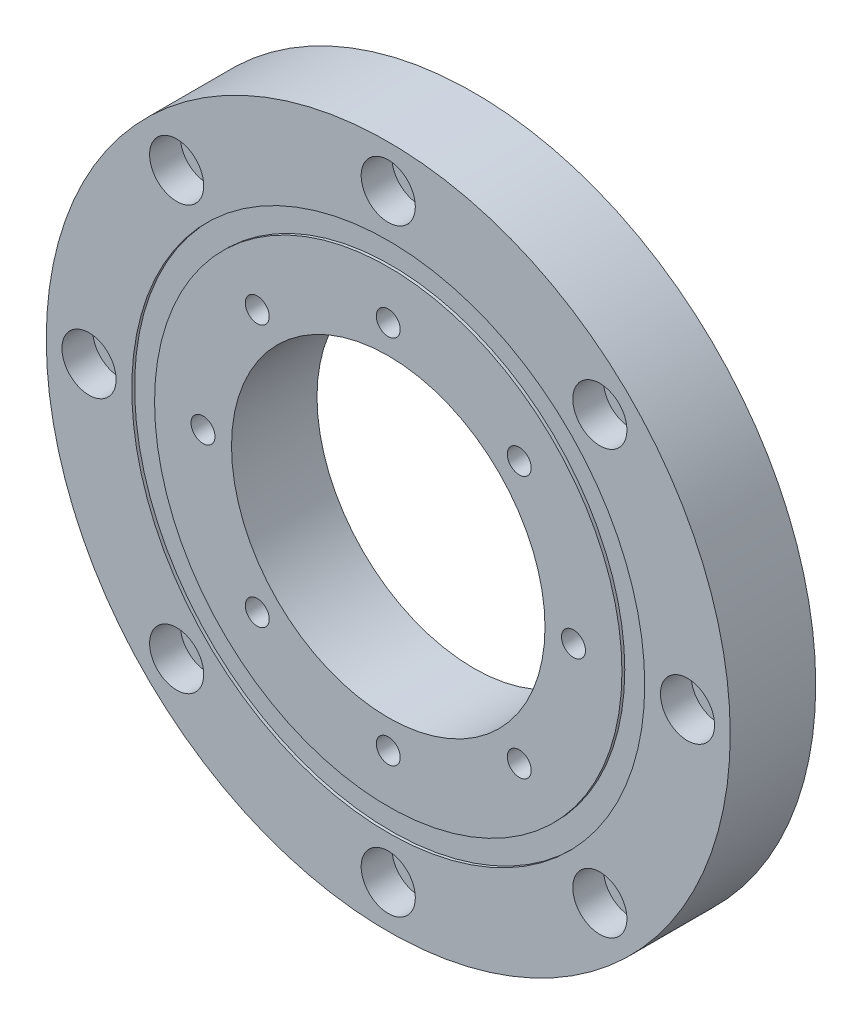
ISO-10303-21;
HEADER;
FILE_DESCRIPTION(('STEP AP214'),'2;1');
FILE_NAME('part.step','',(''),(''),'','','');
FILE_SCHEMA(('AUTOMOTIVE_DESIGN { 1 0 10303 214 1 1 1 1 }'));
ENDSEC;
DATA;
#1=APPLICATION_CONTEXT('core data for automotive mechanical design processes');
#2=APPLICATION_PROTOCOL_DEFINITION('international standard','automotive_design',2000,#1);
#3=PRODUCT_CONTEXT('',#1,'mechanical');
#4=PRODUCT('Part','Part','',(#3));
#5=PRODUCT_RELATED_PRODUCT_CATEGORY('part','',(#4));
#6=PRODUCT_DEFINITION_FORMATION('','',#4);
#7=PRODUCT_DEFINITION_CONTEXT('part definition',#1,'design');
#8=PRODUCT_DEFINITION('design','',#6,#7);
#9=PRODUCT_DEFINITION_SHAPE('','',#8);
#10=(LENGTH_UNIT() NAMED_UNIT(*) SI_UNIT(.MILLI.,.METRE.));
#11=(NAMED_UNIT(*) PLANE_ANGLE_UNIT() SI_UNIT($,.RADIAN.));
#12=(NAMED_UNIT(*) SI_UNIT($,.STERADIAN.) SOLID_ANGLE_UNIT());
#13=UNCERTAINTY_MEASURE_WITH_UNIT(LENGTH_MEASURE(1.E-05),#10,'distance_accuracy_value','');
#14=(GEOMETRIC_REPRESENTATION_CONTEXT(3) GLOBAL_UNCERTAINTY_ASSIGNED_CONTEXT((#13)) GLOBAL_UNIT_ASSIGNED_CONTEXT((#10,
#11,#12)) REPRESENTATION_CONTEXT('',''));
#15=CARTESIAN_POINT('',(0.,0.,0.));
#16=DIRECTION('',(0.,0.,1.));
#17=DIRECTION('',(1.,0.,0.));
#18=AXIS2_PLACEMENT_3D('',#15,#16,#17);
#19=CARTESIAN_POINT('',(0.,0.,-7.5));
#20=DIRECTION('',(0.,0.,1.));
#21=DIRECTION('',(1.,0.,0.));
#22=AXIS2_PLACEMENT_3D('',#19,#20,#21);
#23=PLANE('',#22);
#24=CARTESIAN_POINT('',(22.9809703885625,22.9809703885631,-7.5));
#25=DIRECTION('',(0.,0.,1.));
#26=DIRECTION('',(1.,0.,0.));
#27=AXIS2_PLACEMENT_3D('',#24,#25,#26);
#28=CIRCLE('',#27,2.1);
#29=CARTESIAN_POINT('',(25.0809703885625,22.9809703885631,-7.5));
#30=VERTEX_POINT('',#29);
#31=EDGE_CURVE('E212',#30,#30,#28,.T.);
#32=ORIENTED_EDGE('',*,*,#31,.T.);
#33=EDGE_LOOP('',(#32));
#34=FACE_BOUND('',#33,.T.);
#35=CARTESIAN_POINT('',(32.5,3.40419430537206E-13,-7.5));
#36=DIRECTION('',(0.,0.,1.));
#37=DIRECTION('',(1.,0.,0.));
#38=AXIS2_PLACEMENT_3D('',#35,#36,#37);
#39=CIRCLE('',#38,2.1);
#40=CARTESIAN_POINT('',(34.6,3.40419430537206E-13,-7.5));
#41=VERTEX_POINT('',#40);
#42=EDGE_CURVE('E206',#41,#41,#39,.T.);
#43=ORIENTED_EDGE('',*,*,#42,.T.);
#44=EDGE_LOOP('',(#43));
#45=FACE_BOUND('',#44,.T.);
#46=CARTESIAN_POINT('',(22.980970388563,-22.9809703885626,-7.5));
#47=DIRECTION('',(0.,0.,1.));
#48=DIRECTION('',(1.,0.,0.));
#49=AXIS2_PLACEMENT_3D('',#46,#47,#48);
#50=CIRCLE('',#49,2.1);
#51=CARTESIAN_POINT('',(25.080970388563,-22.9809703885626,-7.5));
#52=VERTEX_POINT('',#51);
#53=EDGE_CURVE('E200',#52,#52,#50,.T.);
#54=ORIENTED_EDGE('',*,*,#53,.T.);
#55=EDGE_LOOP('',(#54));
#56=FACE_BOUND('',#55,.T.);
#57=CARTESIAN_POINT('',(0.,-32.5,-7.5));
#58=DIRECTION('',(0.,0.,1.));
#59=DIRECTION('',(1.,0.,0.));
#60=AXIS2_PLACEMENT_3D('',#57,#58,#59);
#61=CIRCLE('',#60,2.1);
#62=CARTESIAN_POINT('',(2.1,-32.5,-7.5));
#63=VERTEX_POINT('',#62);
#64=EDGE_CURVE('E194',#63,#63,#61,.T.);
#65=ORIENTED_EDGE('',*,*,#64,.T.);
#66=EDGE_LOOP('',(#65));
#67=FACE_BOUND('',#66,.T.);
#68=CARTESIAN_POINT('',(-22.9809703885627,-22.9809703885629,-7.5));
#69=DIRECTION('',(0.,0.,1.));
#70=DIRECTION('',(1.,0.,0.));
#71=AXIS2_PLACEMENT_3D('',#68,#69,#70);
#72=CIRCLE('',#71,2.1);
#73=CARTESIAN_POINT('',(-20.8809703885627,-22.9809703885629,-7.5));
#74=VERTEX_POINT('',#73);
#75=EDGE_CURVE('E188',#74,#74,#72,.T.);
#76=ORIENTED_EDGE('',*,*,#75,.T.);
#77=EDGE_LOOP('',(#76));
#78=FACE_BOUND('',#77,.T.);
#79=CARTESIAN_POINT('',(-32.5,-1.13473143512402E-13,-7.5));
#80=DIRECTION('',(0.,0.,1.));
#81=DIRECTION('',(1.,0.,0.));
#82=AXIS2_PLACEMENT_3D('',#79,#80,#81);
#83=CIRCLE('',#82,2.1);
#84=CARTESIAN_POINT('',(-30.4,-1.13473143512402E-13,-7.5));
#85=VERTEX_POINT('',#84);
#86=EDGE_CURVE('E182',#85,#85,#83,.T.);
#87=ORIENTED_EDGE('',*,*,#86,.T.);
#88=EDGE_LOOP('',(#87));
#89=FACE_BOUND('',#88,.T.);
#90=CARTESIAN_POINT('',(-22.9809703885628,22.9809703885628,-7.5));
#91=DIRECTION('',(0.,0.,1.));
#92=DIRECTION('',(1.,0.,0.));
#93=AXIS2_PLACEMENT_3D('',#90,#91,#92);
#94=CIRCLE('',#93,2.1);
#95=CARTESIAN_POINT('',(-20.8809703885628,22.9809703885628,-7.5));
#96=VERTEX_POINT('',#95);
#97=EDGE_CURVE('E176',#96,#96,#94,.T.);
#98=ORIENTED_EDGE('',*,*,#97,.T.);
#99=EDGE_LOOP('',(#98));
#100=FACE_BOUND('',#99,.T.);
#101=CARTESIAN_POINT('',(0.,32.5,-7.5));
#102=DIRECTION('',(0.,0.,1.));
#103=DIRECTION('',(1.,0.,0.));
#104=AXIS2_PLACEMENT_3D('',#101,#102,#103);
#105=CIRCLE('',#104,2.1);
#106=CARTESIAN_POINT('',(2.1,32.5,-7.5));
#107=VERTEX_POINT('',#106);
#108=EDGE_CURVE('E86',#107,#107,#105,.T.);
#109=ORIENTED_EDGE('',*,*,#108,.T.);
#110=EDGE_LOOP('',(#109));
#111=FACE_BOUND('',#110,.T.);
#112=CARTESIAN_POINT('',(0.,0.,-7.5));
#113=DIRECTION('',(0.,0.,1.));
#114=DIRECTION('',(1.,0.,0.));
#115=AXIS2_PLACEMENT_3D('',#112,#113,#114);
#116=CIRCLE('',#115,27.5);
#117=CARTESIAN_POINT('',(27.5,0.,-7.5));
#118=VERTEX_POINT('',#117);
#119=EDGE_CURVE('E43',#118,#118,#116,.T.);
#120=ORIENTED_EDGE('',*,*,#119,.T.);
#121=EDGE_LOOP('',(#120));
#122=FACE_BOUND('',#121,.T.);
#123=CARTESIAN_POINT('',(0.,0.,-7.5));
#124=DIRECTION('',(0.,0.,1.));
#125=DIRECTION('',(1.,0.,0.));
#126=AXIS2_PLACEMENT_3D('',#123,#124,#125);
#127=CIRCLE('',#126,41.);
#128=CARTESIAN_POINT('',(41.,0.,-7.5));
#129=VERTEX_POINT('',#128);
#130=EDGE_CURVE('E69',#129,#129,#127,.T.);
#131=ORIENTED_EDGE('',*,*,#130,.F.);
#132=EDGE_LOOP('',(#131));
#133=FACE_BOUND('',#132,.T.);
#134=ADVANCED_FACE('F32',(#34,#45,#56,#67,#78,#89,#100,#111,#122,#133),#23,.F.);
#135=CARTESIAN_POINT('',(0.,0.,7.5));
#136=DIRECTION('',(0.,0.,1.));
#137=DIRECTION('',(1.,0.,0.));
#138=AXIS2_PLACEMENT_3D('',#135,#136,#137);
#139=PLANE('',#138);
#140=CARTESIAN_POINT('',(22.9809703885625,22.9809703885631,7.5));
#141=DIRECTION('',(0.,0.,1.));
#142=DIRECTION('',(1.,0.,0.));
#143=AXIS2_PLACEMENT_3D('',#140,#141,#142);
#144=CIRCLE('',#143,2.09999999999999);
#145=CARTESIAN_POINT('',(25.0809703885625,22.9809703885631,7.5));
#146=VERTEX_POINT('',#145);
#147=EDGE_CURVE('E215',#146,#146,#144,.T.);
#148=ORIENTED_EDGE('',*,*,#147,.F.);
#149=EDGE_LOOP('',(#148));
#150=FACE_BOUND('',#149,.T.);
#151=CARTESIAN_POINT('',(32.5,3.40419430537206E-13,7.5));
#152=DIRECTION('',(0.,0.,1.));
#153=DIRECTION('',(1.,0.,0.));
#154=AXIS2_PLACEMENT_3D('',#151,#152,#153);
#155=CIRCLE('',#154,2.09999999999999);
#156=CARTESIAN_POINT('',(34.6,3.40419430537206E-13,7.5));
#157=VERTEX_POINT('',#156);
#158=EDGE_CURVE('E209',#157,#157,#155,.T.);
#159=ORIENTED_EDGE('',*,*,#158,.F.);
#160=EDGE_LOOP('',(#159));
#161=FACE_BOUND('',#160,.T.);
#162=CARTESIAN_POINT('',(22.980970388563,-22.9809703885626,7.5));
#163=DIRECTION('',(0.,0.,1.));
#164=DIRECTION('',(1.,0.,0.));
#165=AXIS2_PLACEMENT_3D('',#162,#163,#164);
#166=CIRCLE('',#165,2.09999999999999);
#167=CARTESIAN_POINT('',(25.080970388563,-22.9809703885626,7.5));
#168=VERTEX_POINT('',#167);
#169=EDGE_CURVE('E203',#168,#168,#166,.T.);
#170=ORIENTED_EDGE('',*,*,#169,.F.);
#171=EDGE_LOOP('',(#170));
#172=FACE_BOUND('',#171,.T.);
#173=CARTESIAN_POINT('',(0.,-32.5,7.5));
#174=DIRECTION('',(0.,0.,1.));
#175=DIRECTION('',(1.,0.,0.));
#176=AXIS2_PLACEMENT_3D('',#173,#174,#175);
#177=CIRCLE('',#176,2.09999999999999);
#178=CARTESIAN_POINT('',(2.09999999999999,-32.5,7.5));
#179=VERTEX_POINT('',#178);
#180=EDGE_CURVE('E197',#179,#179,#177,.T.);
#181=ORIENTED_EDGE('',*,*,#180,.F.);
#182=EDGE_LOOP('',(#181));
#183=FACE_BOUND('',#182,.T.);
#184=CARTESIAN_POINT('',(-22.9809703885627,-22.9809703885629,7.5));
#185=DIRECTION('',(0.,0.,1.));
#186=DIRECTION('',(1.,0.,0.));
#187=AXIS2_PLACEMENT_3D('',#184,#185,#186);
#188=CIRCLE('',#187,2.09999999999999);
#189=CARTESIAN_POINT('',(-20.8809703885627,-22.9809703885629,7.5));
#190=VERTEX_POINT('',#189);
#191=EDGE_CURVE('E191',#190,#190,#188,.T.);
#192=ORIENTED_EDGE('',*,*,#191,.F.);
#193=EDGE_LOOP('',(#192));
#194=FACE_BOUND('',#193,.T.);
#195=CARTESIAN_POINT('',(-32.5,-1.13473143512402E-13,7.5));
#196=DIRECTION('',(0.,0.,1.));
#197=DIRECTION('',(1.,0.,0.));
#198=AXIS2_PLACEMENT_3D('',#195,#196,#197);
#199=CIRCLE('',#198,2.09999999999999);
#200=CARTESIAN_POINT('',(-30.4,-1.13473143512402E-13,7.5));
#201=VERTEX_POINT('',#200);
#202=EDGE_CURVE('E185',#201,#201,#199,.T.);
#203=ORIENTED_EDGE('',*,*,#202,.F.);
#204=EDGE_LOOP('',(#203));
#205=FACE_BOUND('',#204,.T.);
#206=CARTESIAN_POINT('',(-22.9809703885628,22.9809703885628,7.5));
#207=DIRECTION('',(0.,0.,1.));
#208=DIRECTION('',(1.,0.,0.));
#209=AXIS2_PLACEMENT_3D('',#206,#207,#208);
#210=CIRCLE('',#209,2.09999999999999);
#211=CARTESIAN_POINT('',(-20.8809703885629,22.9809703885628,7.5));
#212=VERTEX_POINT('',#211);
#213=EDGE_CURVE('E179',#212,#212,#210,.T.);
#214=ORIENTED_EDGE('',*,*,#213,.F.);
#215=EDGE_LOOP('',(#214));
#216=FACE_BOUND('',#215,.T.);
#217=CARTESIAN_POINT('',(0.,32.5,7.5));
#218=DIRECTION('',(0.,0.,1.));
#219=DIRECTION('',(1.,0.,0.));
#220=AXIS2_PLACEMENT_3D('',#217,#218,#219);
#221=CIRCLE('',#220,2.09999999999999);
#222=CARTESIAN_POINT('',(2.09999999999999,32.5,7.5));
#223=VERTEX_POINT('',#222);
#224=EDGE_CURVE('E89',#223,#223,#221,.T.);
#225=ORIENTED_EDGE('',*,*,#224,.F.);
#226=EDGE_LOOP('',(#225));
#227=FACE_BOUND('',#226,.T.);
#228=CARTESIAN_POINT('',(0.,0.,7.5));
#229=DIRECTION('',(0.,0.,1.));
#230=DIRECTION('',(1.,0.,0.));
#231=AXIS2_PLACEMENT_3D('',#228,#229,#230);
#232=CIRCLE('',#231,27.5);
#233=CARTESIAN_POINT('',(27.5,0.,7.5));
#234=VERTEX_POINT('',#233);
#235=EDGE_CURVE('E45',#234,#234,#232,.T.);
#236=ORIENTED_EDGE('',*,*,#235,.F.);
#237=EDGE_LOOP('',(#236));
#238=FACE_BOUND('',#237,.T.);
#239=CARTESIAN_POINT('',(0.,0.,7.5));
#240=DIRECTION('',(0.,0.,1.));
#241=DIRECTION('',(1.,0.,0.));
#242=AXIS2_PLACEMENT_3D('',#239,#240,#241);
#243=CIRCLE('',#242,41.);
#244=CARTESIAN_POINT('',(41.,0.,7.5));
#245=VERTEX_POINT('',#244);
#246=EDGE_CURVE('E57',#245,#245,#243,.T.);
#247=ORIENTED_EDGE('',*,*,#246,.T.);
#248=EDGE_LOOP('',(#247));
#249=FACE_BOUND('',#248,.T.);
#250=ADVANCED_FACE('F221',(#150,#161,#172,#183,#194,#205,#216,#227,#238,#249),#139,.T.);
#251=CARTESIAN_POINT('',(0.,0.,7.5));
#252=DIRECTION('',(0.,0.,-1.));
#253=DIRECTION('',(-1.,0.,0.));
#254=AXIS2_PLACEMENT_3D('',#251,#252,#253);
#255=CYLINDRICAL_SURFACE('',#254,60.);
#256=CARTESIAN_POINT('',(0.,0.,7.5));
#257=DIRECTION('',(0.,0.,1.));
#258=DIRECTION('',(1.,0.,0.));
#259=AXIS2_PLACEMENT_3D('',#256,#257,#258);
#260=CIRCLE('',#259,60.);
#261=CARTESIAN_POINT('',(60.,0.,7.5));
#262=VERTEX_POINT('',#261);
#263=EDGE_CURVE('E10',#262,#262,#260,.T.);
#264=ORIENTED_EDGE('',*,*,#263,.F.);
#265=EDGE_LOOP('',(#264));
#266=FACE_BOUND('',#265,.T.);
#267=CARTESIAN_POINT('',(0.,0.,-7.5));
#268=DIRECTION('',(0.,0.,1.));
#269=DIRECTION('',(1.,0.,0.));
#270=AXIS2_PLACEMENT_3D('',#267,#268,#269);
#271=CIRCLE('',#270,60.);
#272=CARTESIAN_POINT('',(60.,0.,-7.5));
#273=VERTEX_POINT('',#272);
#274=EDGE_CURVE('E36',#273,#273,#271,.T.);
#275=ORIENTED_EDGE('',*,*,#274,.T.);
#276=EDGE_LOOP('',(#275));
#277=FACE_BOUND('',#276,.T.);
#278=ADVANCED_FACE('F34',(#266,#277),#255,.T.);
#279=CARTESIAN_POINT('',(37.1231060122933,37.1231060122942,7.5));
#280=DIRECTION('',(0.,0.,1.));
#281=DIRECTION('',(1.,0.,0.));
#282=AXIS2_PLACEMENT_3D('',#279,#280,#281);
#283=CIRCLE('',#282,4.75);
#284=CARTESIAN_POINT('',(41.8731060122933,37.1231060122942,7.5));
#285=VERTEX_POINT('',#284);
#286=EDGE_CURVE('E173',#285,#285,#283,.T.);
#287=ORIENTED_EDGE('',*,*,#286,.F.);
#288=EDGE_LOOP('',(#287));
#289=FACE_BOUND('',#288,.T.);
#290=CARTESIAN_POINT('',(52.5,5.42866591772696E-13,7.5));
#291=DIRECTION('',(0.,0.,1.));
#292=DIRECTION('',(1.,0.,0.));
#293=AXIS2_PLACEMENT_3D('',#290,#291,#292);
#294=CIRCLE('',#293,4.75);
#295=CARTESIAN_POINT('',(57.25,5.42866591772696E-13,7.5));
#296=VERTEX_POINT('',#295);
#297=EDGE_CURVE('E161',#296,#296,#294,.T.);
#298=ORIENTED_EDGE('',*,*,#297,.F.);
#299=EDGE_LOOP('',(#298));
#300=FACE_BOUND('',#299,.T.);
#301=CARTESIAN_POINT('',(37.1231060122941,-37.1231060122934,7.5));
#302=DIRECTION('',(0.,0.,1.));
#303=DIRECTION('',(1.,0.,0.));
#304=AXIS2_PLACEMENT_3D('',#301,#302,#303);
#305=CIRCLE('',#304,4.75);
#306=CARTESIAN_POINT('',(41.8731060122941,-37.1231060122934,7.5));
#307=VERTEX_POINT('',#306);
#308=EDGE_CURVE('E149',#307,#307,#305,.T.);
#309=ORIENTED_EDGE('',*,*,#308,.F.);
#310=EDGE_LOOP('',(#309));
#311=FACE_BOUND('',#310,.T.);
#312=CARTESIAN_POINT('',(0.,-52.5,7.5));
#313=DIRECTION('',(0.,0.,1.));
#314=DIRECTION('',(1.,0.,0.));
#315=AXIS2_PLACEMENT_3D('',#312,#313,#314);
#316=CIRCLE('',#315,4.75);
#317=CARTESIAN_POINT('',(4.74999999999999,-52.5,7.5));
#318=VERTEX_POINT('',#317);
#319=EDGE_CURVE('E137',#318,#318,#316,.T.);
#320=ORIENTED_EDGE('',*,*,#319,.F.);
#321=EDGE_LOOP('',(#320));
#322=FACE_BOUND('',#321,.T.);
#323=CARTESIAN_POINT('',(-37.1231060122936,-37.1231060122939,7.5));
#324=DIRECTION('',(0.,0.,1.));
#325=DIRECTION('',(1.,0.,0.));
#326=AXIS2_PLACEMENT_3D('',#323,#324,#325);
#327=CIRCLE('',#326,4.75);
#328=CARTESIAN_POINT('',(-32.3731060122936,-37.1231060122939,7.5));
#329=VERTEX_POINT('',#328);
#330=EDGE_CURVE('E125',#329,#329,#327,.T.);
#331=ORIENTED_EDGE('',*,*,#330,.F.);
#332=EDGE_LOOP('',(#331));
#333=FACE_BOUND('',#332,.T.);
#334=CARTESIAN_POINT('',(-52.5,-1.76261051194167E-13,7.5));
#335=DIRECTION('',(0.,0.,1.));
#336=DIRECTION('',(1.,0.,0.));
#337=AXIS2_PLACEMENT_3D('',#334,#335,#336);
#338=CIRCLE('',#337,4.75);
#339=CARTESIAN_POINT('',(-47.75,-1.76261051194167E-13,7.5));
#340=VERTEX_POINT('',#339);
#341=EDGE_CURVE('E113',#340,#340,#338,.T.);
#342=ORIENTED_EDGE('',*,*,#341,.F.);
#343=EDGE_LOOP('',(#342));
#344=FACE_BOUND('',#343,.T.);
#345=CARTESIAN_POINT('',(-37.1231060122938,37.1231060122937,7.5));
#346=DIRECTION('',(0.,0.,1.));
#347=DIRECTION('',(1.,0.,0.));
#348=AXIS2_PLACEMENT_3D('',#345,#346,#347);
#349=CIRCLE('',#348,4.75);
#350=CARTESIAN_POINT('',(-32.3731060122938,37.1231060122937,7.5));
#351=VERTEX_POINT('',#350);
#352=EDGE_CURVE('E101',#351,#351,#349,.T.);
#353=ORIENTED_EDGE('',*,*,#352,.F.);
#354=EDGE_LOOP('',(#353));
#355=FACE_BOUND('',#354,.T.);
#356=CARTESIAN_POINT('',(0.,52.5,7.5));
#357=DIRECTION('',(0.,0.,1.));
#358=DIRECTION('',(1.,0.,0.));
#359=AXIS2_PLACEMENT_3D('',#356,#357,#358);
#360=CIRCLE('',#359,4.75);
#361=CARTESIAN_POINT('',(4.75000000000001,52.5,7.5));
#362=VERTEX_POINT('',#361);
#363=EDGE_CURVE('E83',#362,#362,#360,.T.);
#364=ORIENTED_EDGE('',*,*,#363,.F.);
#365=EDGE_LOOP('',(#364));
#366=FACE_BOUND('',#365,.T.);
#367=CARTESIAN_POINT('',(0.,0.,7.5));
#368=DIRECTION('',(0.,0.,1.));
#369=DIRECTION('',(1.,0.,0.));
#370=AXIS2_PLACEMENT_3D('',#367,#368,#369);
#371=CIRCLE('',#370,45.);
#372=CARTESIAN_POINT('',(45.,0.,7.5));
#373=VERTEX_POINT('',#372);
#374=EDGE_CURVE('E51',#373,#373,#371,.T.);
#375=ORIENTED_EDGE('',*,*,#374,.F.);
#376=EDGE_LOOP('',(#375));
#377=FACE_BOUND('',#376,.T.);
#378=ORIENTED_EDGE('',*,*,#263,.T.);
#379=EDGE_LOOP('',(#378));
#380=FACE_BOUND('',#379,.T.);
#381=ADVANCED_FACE('F225',(#289,#300,#311,#322,#333,#344,#355,#366,#377,#380),#139,.T.);
#382=CARTESIAN_POINT('',(37.1231060122933,37.1231060122942,-7.5));
#383=DIRECTION('',(0.,0.,1.));
#384=DIRECTION('',(1.,0.,0.));
#385=AXIS2_PLACEMENT_3D('',#382,#383,#384);
#386=CIRCLE('',#385,2.75);
#387=CARTESIAN_POINT('',(39.8731060122933,37.1231060122942,-7.5));
#388=VERTEX_POINT('',#387);
#389=EDGE_CURVE('E164',#388,#388,#386,.T.);
#390=ORIENTED_EDGE('',*,*,#389,.T.);
#391=EDGE_LOOP('',(#390));
#392=FACE_BOUND('',#391,.T.);
#393=CARTESIAN_POINT('',(52.5,5.42866591772696E-13,-7.5));
#394=DIRECTION('',(0.,0.,1.));
#395=DIRECTION('',(1.,0.,0.));
#396=AXIS2_PLACEMENT_3D('',#393,#394,#395);
#397=CIRCLE('',#396,2.75);
#398=CARTESIAN_POINT('',(55.25,5.42866591772696E-13,-7.5));
#399=VERTEX_POINT('',#398);
#400=EDGE_CURVE('E152',#399,#399,#397,.T.);
#401=ORIENTED_EDGE('',*,*,#400,.T.);
#402=EDGE_LOOP('',(#401));
#403=FACE_BOUND('',#402,.T.);
#404=CARTESIAN_POINT('',(37.1231060122941,-37.1231060122934,-7.5));
#405=DIRECTION('',(0.,0.,1.));
#406=DIRECTION('',(1.,0.,0.));
#407=AXIS2_PLACEMENT_3D('',#404,#405,#406);
#408=CIRCLE('',#407,2.75);
#409=CARTESIAN_POINT('',(39.8731060122941,-37.1231060122934,-7.5));
#410=VERTEX_POINT('',#409);
#411=EDGE_CURVE('E140',#410,#410,#408,.T.);
#412=ORIENTED_EDGE('',*,*,#411,.T.);
#413=EDGE_LOOP('',(#412));
#414=FACE_BOUND('',#413,.T.);
#415=CARTESIAN_POINT('',(0.,-52.5,-7.5));
#416=DIRECTION('',(0.,0.,1.));
#417=DIRECTION('',(1.,0.,0.));
#418=AXIS2_PLACEMENT_3D('',#415,#416,#417);
#419=CIRCLE('',#418,2.75);
#420=CARTESIAN_POINT('',(2.74999999999999,-52.5,-7.5));
#421=VERTEX_POINT('',#420);
#422=EDGE_CURVE('E128',#421,#421,#419,.T.);
#423=ORIENTED_EDGE('',*,*,#422,.T.);
#424=EDGE_LOOP('',(#423));
#425=FACE_BOUND('',#424,.T.);
#426=CARTESIAN_POINT('',(-37.1231060122936,-37.1231060122939,-7.5));
#427=DIRECTION('',(0.,0.,1.));
#428=DIRECTION('',(1.,0.,0.));
#429=AXIS2_PLACEMENT_3D('',#426,#427,#428);
#430=CIRCLE('',#429,2.75);
#431=CARTESIAN_POINT('',(-34.3731060122936,-37.1231060122939,-7.5));
#432=VERTEX_POINT('',#431);
#433=EDGE_CURVE('E116',#432,#432,#430,.T.);
#434=ORIENTED_EDGE('',*,*,#433,.T.);
#435=EDGE_LOOP('',(#434));
#436=FACE_BOUND('',#435,.T.);
#437=CARTESIAN_POINT('',(-52.5,-1.76261051194167E-13,-7.5));
#438=DIRECTION('',(0.,0.,1.));
#439=DIRECTION('',(1.,0.,0.));
#440=AXIS2_PLACEMENT_3D('',#437,#438,#439);
#441=CIRCLE('',#440,2.75);
#442=CARTESIAN_POINT('',(-49.75,-1.76261051194167E-13,-7.5));
#443=VERTEX_POINT('',#442);
#444=EDGE_CURVE('E104',#443,#443,#441,.T.);
#445=ORIENTED_EDGE('',*,*,#444,.T.);
#446=EDGE_LOOP('',(#445));
#447=FACE_BOUND('',#446,.T.);
#448=CARTESIAN_POINT('',(-37.1231060122938,37.1231060122937,-7.5));
#449=DIRECTION('',(0.,0.,1.));
#450=DIRECTION('',(1.,0.,0.));
#451=AXIS2_PLACEMENT_3D('',#448,#449,#450);
#452=CIRCLE('',#451,2.75);
#453=CARTESIAN_POINT('',(-34.3731060122938,37.1231060122937,-7.5));
#454=VERTEX_POINT('',#453);
#455=EDGE_CURVE('E92',#454,#454,#452,.T.);
#456=ORIENTED_EDGE('',*,*,#455,.T.);
#457=EDGE_LOOP('',(#456));
#458=FACE_BOUND('',#457,.T.);
#459=CARTESIAN_POINT('',(0.,52.5,-7.5));
#460=DIRECTION('',(0.,0.,1.));
#461=DIRECTION('',(1.,0.,0.));
#462=AXIS2_PLACEMENT_3D('',#459,#460,#461);
#463=CIRCLE('',#462,2.75);
#464=CARTESIAN_POINT('',(2.75,52.5,-7.5));
#465=VERTEX_POINT('',#464);
#466=EDGE_CURVE('E72',#465,#465,#463,.T.);
#467=ORIENTED_EDGE('',*,*,#466,.T.);
#468=EDGE_LOOP('',(#467));
#469=FACE_BOUND('',#468,.T.);
#470=CARTESIAN_POINT('',(0.,0.,-7.5));
#471=DIRECTION('',(0.,0.,1.));
#472=DIRECTION('',(1.,0.,0.));
#473=AXIS2_PLACEMENT_3D('',#470,#471,#472);
#474=CIRCLE('',#473,45.);
#475=CARTESIAN_POINT('',(45.,0.,-7.5));
#476=VERTEX_POINT('',#475);
#477=EDGE_CURVE('E63',#476,#476,#474,.T.);
#478=ORIENTED_EDGE('',*,*,#477,.T.);
#479=EDGE_LOOP('',(#478));
#480=FACE_BOUND('',#479,.T.);
#481=ORIENTED_EDGE('',*,*,#274,.F.);
#482=EDGE_LOOP('',(#481));
#483=FACE_BOUND('',#482,.T.);
#484=ADVANCED_FACE('F263',(#392,#403,#414,#425,#436,#447,#458,#469,#480,#483),#23,.F.);
#485=CARTESIAN_POINT('',(0.,0.,-7.5));
#486=DIRECTION('',(0.,0.,1.));
#487=DIRECTION('',(1.,0.,0.));
#488=AXIS2_PLACEMENT_3D('',#485,#486,#487);
#489=CYLINDRICAL_SURFACE('',#488,27.5);
#490=ORIENTED_EDGE('',*,*,#119,.F.);
#491=EDGE_LOOP('',(#490));
#492=FACE_BOUND('',#491,.T.);
#493=ORIENTED_EDGE('',*,*,#235,.T.);
#494=EDGE_LOOP('',(#493));
#495=FACE_BOUND('',#494,.T.);
#496=ADVANCED_FACE('F269',(#492,#495),#489,.F.);
#497=CARTESIAN_POINT('',(0.,0.,7.));
#498=DIRECTION('',(0.,0.,1.));
#499=DIRECTION('',(1.,0.,0.));
#500=AXIS2_PLACEMENT_3D('',#497,#498,#499);
#501=CYLINDRICAL_SURFACE('',#500,45.);
#502=CARTESIAN_POINT('',(0.,0.,7.));
#503=DIRECTION('',(0.,0.,1.));
#504=DIRECTION('',(1.,0.,0.));
#505=AXIS2_PLACEMENT_3D('',#502,#503,#504);
#506=CIRCLE('',#505,45.);
#507=CARTESIAN_POINT('',(45.,0.,7.));
#508=VERTEX_POINT('',#507);
#509=EDGE_CURVE('E48',#508,#508,#506,.T.);
#510=ORIENTED_EDGE('',*,*,#509,.F.);
#511=EDGE_LOOP('',(#510));
#512=FACE_BOUND('',#511,.T.);
#513=ORIENTED_EDGE('',*,*,#374,.T.);
#514=EDGE_LOOP('',(#513));
#515=FACE_BOUND('',#514,.T.);
#516=ADVANCED_FACE('F257',(#512,#515),#501,.F.);
#517=CARTESIAN_POINT('',(0.,0.,7.));
#518=DIRECTION('',(0.,0.,1.));
#519=DIRECTION('',(1.,0.,0.));
#520=AXIS2_PLACEMENT_3D('',#517,#518,#519);
#521=PLANE('',#520);
#522=CARTESIAN_POINT('',(0.,0.,7.));
#523=DIRECTION('',(0.,0.,1.));
#524=DIRECTION('',(1.,0.,0.));
#525=AXIS2_PLACEMENT_3D('',#522,#523,#524);
#526=CIRCLE('',#525,41.);
#527=CARTESIAN_POINT('',(41.,0.,7.));
#528=VERTEX_POINT('',#527);
#529=EDGE_CURVE('E54',#528,#528,#526,.T.);
#530=ORIENTED_EDGE('',*,*,#529,.F.);
#531=EDGE_LOOP('',(#530));
#532=FACE_BOUND('',#531,.T.);
#533=ORIENTED_EDGE('',*,*,#509,.T.);
#534=EDGE_LOOP('',(#533));
#535=FACE_BOUND('',#534,.T.);
#536=ADVANCED_FACE('F247',(#532,#535),#521,.T.);
#537=CARTESIAN_POINT('',(0.,0.,7.));
#538=DIRECTION('',(0.,0.,1.));
#539=DIRECTION('',(1.,0.,0.));
#540=AXIS2_PLACEMENT_3D('',#537,#538,#539);
#541=CYLINDRICAL_SURFACE('',#540,41.);
#542=ORIENTED_EDGE('',*,*,#529,.T.);
#543=EDGE_LOOP('',(#542));
#544=FACE_BOUND('',#543,.T.);
#545=ORIENTED_EDGE('',*,*,#246,.F.);
#546=EDGE_LOOP('',(#545));
#547=FACE_BOUND('',#546,.T.);
#548=ADVANCED_FACE('F244',(#544,#547),#541,.T.);
#549=CARTESIAN_POINT('',(0.,0.,-7.));
#550=DIRECTION('',(0.,0.,-1.));
#551=DIRECTION('',(1.,0.,0.));
#552=AXIS2_PLACEMENT_3D('',#549,#550,#551);
#553=PLANE('',#552);
#554=CARTESIAN_POINT('',(0.,0.,-7.));
#555=DIRECTION('',(0.,0.,1.));
#556=DIRECTION('',(1.,0.,0.));
#557=AXIS2_PLACEMENT_3D('',#554,#555,#556);
#558=CIRCLE('',#557,45.);
#559=CARTESIAN_POINT('',(45.,0.,-7.));
#560=VERTEX_POINT('',#559);
#561=EDGE_CURVE('E60',#560,#560,#558,.T.);
#562=ORIENTED_EDGE('',*,*,#561,.F.);
#563=EDGE_LOOP('',(#562));
#564=FACE_BOUND('',#563,.T.);
#565=CARTESIAN_POINT('',(0.,0.,-7.));
#566=DIRECTION('',(0.,0.,1.));
#567=DIRECTION('',(1.,0.,0.));
#568=AXIS2_PLACEMENT_3D('',#565,#566,#567);
#569=CIRCLE('',#568,41.);
#570=CARTESIAN_POINT('',(41.,0.,-7.));
#571=VERTEX_POINT('',#570);
#572=EDGE_CURVE('E66',#571,#571,#569,.T.);
#573=ORIENTED_EDGE('',*,*,#572,.T.);
#574=EDGE_LOOP('',(#573));
#575=FACE_BOUND('',#574,.T.);
#576=ADVANCED_FACE('F246',(#564,#575),#553,.T.);
#577=CARTESIAN_POINT('',(0.,0.,-7.));
#578=DIRECTION('',(0.,0.,-1.));
#579=DIRECTION('',(-1.,0.,0.));
#580=AXIS2_PLACEMENT_3D('',#577,#578,#579);
#581=CYLINDRICAL_SURFACE('',#580,45.);
#582=ORIENTED_EDGE('',*,*,#561,.T.);
#583=EDGE_LOOP('',(#582));
#584=FACE_BOUND('',#583,.T.);
#585=ORIENTED_EDGE('',*,*,#477,.F.);
#586=EDGE_LOOP('',(#585));
#587=FACE_BOUND('',#586,.T.);
#588=ADVANCED_FACE('F254',(#584,#587),#581,.F.);
#589=CARTESIAN_POINT('',(0.,0.,-7.));
#590=DIRECTION('',(0.,0.,-1.));
#591=DIRECTION('',(-1.,0.,0.));
#592=AXIS2_PLACEMENT_3D('',#589,#590,#591);
#593=CYLINDRICAL_SURFACE('',#592,41.);
#594=ORIENTED_EDGE('',*,*,#572,.F.);
#595=EDGE_LOOP('',(#594));
#596=FACE_BOUND('',#595,.T.);
#597=ORIENTED_EDGE('',*,*,#130,.T.);
#598=EDGE_LOOP('',(#597));
#599=FACE_BOUND('',#598,.T.);
#600=ADVANCED_FACE('F354',(#596,#599),#593,.T.);
#601=CARTESIAN_POINT('',(0.,52.5,7.5));
#602=DIRECTION('',(0.,0.,1.));
#603=DIRECTION('',(1.,0.,0.));
#604=AXIS2_PLACEMENT_3D('',#601,#602,#603);
#605=CYLINDRICAL_SURFACE('',#604,2.75);
#606=ORIENTED_EDGE('',*,*,#466,.F.);
#607=EDGE_LOOP('',(#606));
#608=FACE_BOUND('',#607,.T.);
#609=CARTESIAN_POINT('',(0.,52.5,2.1));
#610=DIRECTION('',(0.,0.,1.));
#611=DIRECTION('',(1.,0.,0.));
#612=AXIS2_PLACEMENT_3D('',#609,#610,#611);
#613=CIRCLE('',#612,2.75);
#614=CARTESIAN_POINT('',(2.75000000000001,52.5,2.1));
#615=VERTEX_POINT('',#614);
#616=EDGE_CURVE('E77',#615,#615,#613,.T.);
#617=ORIENTED_EDGE('',*,*,#616,.T.);
#618=EDGE_LOOP('',(#617));
#619=FACE_BOUND('',#618,.T.);
#620=ADVANCED_FACE('F363',(#608,#619),#605,.F.);
#621=CARTESIAN_POINT('',(2.75000000000001,52.5,2.1));
#622=DIRECTION('',(0.,0.,-1.));
#623=DIRECTION('',(-1.,0.,0.));
#624=AXIS2_PLACEMENT_3D('',#621,#622,#623);
#625=PLANE('',#624);
#626=ORIENTED_EDGE('',*,*,#616,.F.);
#627=EDGE_LOOP('',(#626));
#628=FACE_BOUND('',#627,.T.);
#629=CARTESIAN_POINT('',(0.,52.5,2.1));
#630=DIRECTION('',(0.,0.,1.));
#631=DIRECTION('',(1.,0.,0.));
#632=AXIS2_PLACEMENT_3D('',#629,#630,#631);
#633=CIRCLE('',#632,4.75);
#634=CARTESIAN_POINT('',(4.75000000000001,52.5,2.1));
#635=VERTEX_POINT('',#634);
#636=EDGE_CURVE('E80',#635,#635,#633,.T.);
#637=ORIENTED_EDGE('',*,*,#636,.T.);
#638=EDGE_LOOP('',(#637));
#639=FACE_BOUND('',#638,.T.);
#640=ADVANCED_FACE('F373',(#628,#639),#625,.F.);
#641=CARTESIAN_POINT('',(0.,52.5,7.5));
#642=DIRECTION('',(0.,0.,1.));
#643=DIRECTION('',(1.,0.,0.));
#644=AXIS2_PLACEMENT_3D('',#641,#642,#643);
#645=CYLINDRICAL_SURFACE('',#644,4.75);
#646=ORIENTED_EDGE('',*,*,#636,.F.);
#647=EDGE_LOOP('',(#646));
#648=FACE_BOUND('',#647,.T.);
#649=ORIENTED_EDGE('',*,*,#363,.T.);
#650=EDGE_LOOP('',(#649));
#651=FACE_BOUND('',#650,.T.);
#652=ADVANCED_FACE('F383',(#648,#651),#645,.F.);
#653=CARTESIAN_POINT('',(0.,32.5,7.5));
#654=DIRECTION('',(0.,0.,1.));
#655=DIRECTION('',(1.,0.,0.));
#656=AXIS2_PLACEMENT_3D('',#653,#654,#655);
#657=CYLINDRICAL_SURFACE('',#656,2.09999999999999);
#658=ORIENTED_EDGE('',*,*,#108,.F.);
#659=EDGE_LOOP('',(#658));
#660=FACE_BOUND('',#659,.T.);
#661=ORIENTED_EDGE('',*,*,#224,.T.);
#662=EDGE_LOOP('',(#661));
#663=FACE_BOUND('',#662,.T.);
#664=ADVANCED_FACE('F392',(#660,#663),#657,.F.);
#665=CARTESIAN_POINT('',(-37.1231060122938,37.1231060122937,7.5));
#666=DIRECTION('',(0.,0.,1.));
#667=DIRECTION('',(1.,0.,0.));
#668=AXIS2_PLACEMENT_3D('',#665,#666,#667);
#669=CYLINDRICAL_SURFACE('',#668,2.75);
#670=ORIENTED_EDGE('',*,*,#455,.F.);
#671=EDGE_LOOP('',(#670));
#672=FACE_BOUND('',#671,.T.);
#673=CARTESIAN_POINT('',(-37.1231060122938,37.1231060122937,2.1));
#674=DIRECTION('',(0.,0.,1.));
#675=DIRECTION('',(1.,0.,0.));
#676=AXIS2_PLACEMENT_3D('',#673,#674,#675);
#677=CIRCLE('',#676,2.75);
#678=CARTESIAN_POINT('',(-34.3731060122938,37.1231060122937,2.1));
#679=VERTEX_POINT('',#678);
#680=EDGE_CURVE('E95',#679,#679,#677,.T.);
#681=ORIENTED_EDGE('',*,*,#680,.T.);
#682=EDGE_LOOP('',(#681));
#683=FACE_BOUND('',#682,.T.);
#684=ADVANCED_FACE('F401',(#672,#683),#669,.F.);
#685=CARTESIAN_POINT('',(-34.3731060122938,37.1231060122937,2.1));
#686=DIRECTION('',(0.,0.,-1.));
#687=DIRECTION('',(-1.,0.,0.));
#688=AXIS2_PLACEMENT_3D('',#685,#686,#687);
#689=PLANE('',#688);
#690=ORIENTED_EDGE('',*,*,#680,.F.);
#691=EDGE_LOOP('',(#690));
#692=FACE_BOUND('',#691,.T.);
#693=CARTESIAN_POINT('',(-37.1231060122938,37.1231060122937,2.1));
#694=DIRECTION('',(0.,0.,1.));
#695=DIRECTION('',(1.,0.,0.));
#696=AXIS2_PLACEMENT_3D('',#693,#694,#695);
#697=CIRCLE('',#696,4.75);
#698=CARTESIAN_POINT('',(-32.3731060122938,37.1231060122937,2.1));
#699=VERTEX_POINT('',#698);
#700=EDGE_CURVE('E98',#699,#699,#697,.T.);
#701=ORIENTED_EDGE('',*,*,#700,.T.);
#702=EDGE_LOOP('',(#701));
#703=FACE_BOUND('',#702,.T.);
#704=ADVANCED_FACE('F411',(#692,#703),#689,.F.);
#705=CARTESIAN_POINT('',(-37.1231060122938,37.1231060122937,7.5));
#706=DIRECTION('',(0.,0.,1.));
#707=DIRECTION('',(1.,0.,0.));
#708=AXIS2_PLACEMENT_3D('',#705,#706,#707);
#709=CYLINDRICAL_SURFACE('',#708,4.75);
#710=ORIENTED_EDGE('',*,*,#700,.F.);
#711=EDGE_LOOP('',(#710));
#712=FACE_BOUND('',#711,.T.);
#713=ORIENTED_EDGE('',*,*,#352,.T.);
#714=EDGE_LOOP('',(#713));
#715=FACE_BOUND('',#714,.T.);
#716=ADVANCED_FACE('F418',(#712,#715),#709,.F.);
#717=CARTESIAN_POINT('',(-52.5,-1.76261051194167E-13,7.5));
#718=DIRECTION('',(0.,0.,1.));
#719=DIRECTION('',(1.,0.,0.));
#720=AXIS2_PLACEMENT_3D('',#717,#718,#719);
#721=CYLINDRICAL_SURFACE('',#720,2.75);
#722=ORIENTED_EDGE('',*,*,#444,.F.);
#723=EDGE_LOOP('',(#722));
#724=FACE_BOUND('',#723,.T.);
#725=CARTESIAN_POINT('',(-52.5,-1.76261051194167E-13,2.1));
#726=DIRECTION('',(0.,0.,1.));
#727=DIRECTION('',(1.,0.,0.));
#728=AXIS2_PLACEMENT_3D('',#725,#726,#727);
#729=CIRCLE('',#728,2.75);
#730=CARTESIAN_POINT('',(-49.75,-1.76261051194167E-13,2.1));
#731=VERTEX_POINT('',#730);
#732=EDGE_CURVE('E107',#731,#731,#729,.T.);
#733=ORIENTED_EDGE('',*,*,#732,.T.);
#734=EDGE_LOOP('',(#733));
#735=FACE_BOUND('',#734,.T.);
#736=ADVANCED_FACE('F426',(#724,#735),#721,.F.);
#737=CARTESIAN_POINT('',(-49.75,-1.76261051194167E-13,2.1));
#738=DIRECTION('',(0.,0.,-1.));
#739=DIRECTION('',(-1.,0.,0.));
#740=AXIS2_PLACEMENT_3D('',#737,#738,#739);
#741=PLANE('',#740);
#742=ORIENTED_EDGE('',*,*,#732,.F.);
#743=EDGE_LOOP('',(#742));
#744=FACE_BOUND('',#743,.T.);
#745=CARTESIAN_POINT('',(-52.5,-1.76261051194167E-13,2.1));
#746=DIRECTION('',(0.,0.,1.));
#747=DIRECTION('',(1.,0.,0.));
#748=AXIS2_PLACEMENT_3D('',#745,#746,#747);
#749=CIRCLE('',#748,4.75);
#750=CARTESIAN_POINT('',(-47.75,-1.76261051194167E-13,2.1));
#751=VERTEX_POINT('',#750);
#752=EDGE_CURVE('E110',#751,#751,#749,.T.);
#753=ORIENTED_EDGE('',*,*,#752,.T.);
#754=EDGE_LOOP('',(#753));
#755=FACE_BOUND('',#754,.T.);
#756=ADVANCED_FACE('F434',(#744,#755),#741,.F.);
#757=CARTESIAN_POINT('',(-52.5,-1.76261051194167E-13,7.5));
#758=DIRECTION('',(0.,0.,1.));
#759=DIRECTION('',(1.,0.,0.));
#760=AXIS2_PLACEMENT_3D('',#757,#758,#759);
#761=CYLINDRICAL_SURFACE('',#760,4.75);
#762=ORIENTED_EDGE('',*,*,#752,.F.);
#763=EDGE_LOOP('',(#762));
#764=FACE_BOUND('',#763,.T.);
#765=ORIENTED_EDGE('',*,*,#341,.T.);
#766=EDGE_LOOP('',(#765));
#767=FACE_BOUND('',#766,.T.);
#768=ADVANCED_FACE('F442',(#764,#767),#761,.F.);
#769=CARTESIAN_POINT('',(-37.1231060122936,-37.1231060122939,7.5));
#770=DIRECTION('',(0.,0.,1.));
#771=DIRECTION('',(1.,0.,0.));
#772=AXIS2_PLACEMENT_3D('',#769,#770,#771);
#773=CYLINDRICAL_SURFACE('',#772,2.75);
#774=ORIENTED_EDGE('',*,*,#433,.F.);
#775=EDGE_LOOP('',(#774));
#776=FACE_BOUND('',#775,.T.);
#777=CARTESIAN_POINT('',(-37.1231060122936,-37.1231060122939,2.1));
#778=DIRECTION('',(0.,0.,1.));
#779=DIRECTION('',(1.,0.,0.));
#780=AXIS2_PLACEMENT_3D('',#777,#778,#779);
#781=CIRCLE('',#780,2.75);
#782=CARTESIAN_POINT('',(-34.3731060122936,-37.1231060122939,2.1));
#783=VERTEX_POINT('',#782);
#784=EDGE_CURVE('E119',#783,#783,#781,.T.);
#785=ORIENTED_EDGE('',*,*,#784,.T.);
#786=EDGE_LOOP('',(#785));
#787=FACE_BOUND('',#786,.T.);
#788=ADVANCED_FACE('F450',(#776,#787),#773,.F.);
#789=CARTESIAN_POINT('',(-34.3731060122936,-37.1231060122939,2.1));
#790=DIRECTION('',(0.,0.,-1.));
#791=DIRECTION('',(-1.,0.,0.));
#792=AXIS2_PLACEMENT_3D('',#789,#790,#791);
#793=PLANE('',#792);
#794=ORIENTED_EDGE('',*,*,#784,.F.);
#795=EDGE_LOOP('',(#794));
#796=FACE_BOUND('',#795,.T.);
#797=CARTESIAN_POINT('',(-37.1231060122936,-37.1231060122939,2.1));
#798=DIRECTION('',(0.,0.,1.));
#799=DIRECTION('',(1.,0.,0.));
#800=AXIS2_PLACEMENT_3D('',#797,#798,#799);
#801=CIRCLE('',#800,4.75);
#802=CARTESIAN_POINT('',(-32.3731060122936,-37.1231060122939,2.1));
#803=VERTEX_POINT('',#802);
#804=EDGE_CURVE('E122',#803,#803,#801,.T.);
#805=ORIENTED_EDGE('',*,*,#804,.T.);
#806=EDGE_LOOP('',(#805));
#807=FACE_BOUND('',#806,.T.);
#808=ADVANCED_FACE('F458',(#796,#807),#793,.F.);
#809=CARTESIAN_POINT('',(-37.1231060122936,-37.1231060122939,7.5));
#810=DIRECTION('',(0.,0.,1.));
#811=DIRECTION('',(1.,0.,0.));
#812=AXIS2_PLACEMENT_3D('',#809,#810,#811);
#813=CYLINDRICAL_SURFACE('',#812,4.75);
#814=ORIENTED_EDGE('',*,*,#804,.F.);
#815=EDGE_LOOP('',(#814));
#816=FACE_BOUND('',#815,.T.);
#817=ORIENTED_EDGE('',*,*,#330,.T.);
#818=EDGE_LOOP('',(#817));
#819=FACE_BOUND('',#818,.T.);
#820=ADVANCED_FACE('F466',(#816,#819),#813,.F.);
#821=CARTESIAN_POINT('',(0.,-52.5,7.5));
#822=DIRECTION('',(0.,0.,1.));
#823=DIRECTION('',(1.,0.,0.));
#824=AXIS2_PLACEMENT_3D('',#821,#822,#823);
#825=CYLINDRICAL_SURFACE('',#824,2.75);
#826=ORIENTED_EDGE('',*,*,#422,.F.);
#827=EDGE_LOOP('',(#826));
#828=FACE_BOUND('',#827,.T.);
#829=CARTESIAN_POINT('',(0.,-52.5,2.1));
#830=DIRECTION('',(0.,0.,1.));
#831=DIRECTION('',(1.,0.,0.));
#832=AXIS2_PLACEMENT_3D('',#829,#830,#831);
#833=CIRCLE('',#832,2.75);
#834=CARTESIAN_POINT('',(2.74999999999999,-52.5,2.1));
#835=VERTEX_POINT('',#834);
#836=EDGE_CURVE('E131',#835,#835,#833,.T.);
#837=ORIENTED_EDGE('',*,*,#836,.T.);
#838=EDGE_LOOP('',(#837));
#839=FACE_BOUND('',#838,.T.);
#840=ADVANCED_FACE('F474',(#828,#839),#825,.F.);
#841=CARTESIAN_POINT('',(2.74999999999999,-52.5,2.1));
#842=DIRECTION('',(0.,0.,-1.));
#843=DIRECTION('',(-1.,0.,0.));
#844=AXIS2_PLACEMENT_3D('',#841,#842,#843);
#845=PLANE('',#844);
#846=ORIENTED_EDGE('',*,*,#836,.F.);
#847=EDGE_LOOP('',(#846));
#848=FACE_BOUND('',#847,.T.);
#849=CARTESIAN_POINT('',(0.,-52.5,2.1));
#850=DIRECTION('',(0.,0.,1.));
#851=DIRECTION('',(1.,0.,0.));
#852=AXIS2_PLACEMENT_3D('',#849,#850,#851);
#853=CIRCLE('',#852,4.75);
#854=CARTESIAN_POINT('',(4.74999999999999,-52.5,2.1));
#855=VERTEX_POINT('',#854);
#856=EDGE_CURVE('E134',#855,#855,#853,.T.);
#857=ORIENTED_EDGE('',*,*,#856,.T.);
#858=EDGE_LOOP('',(#857));
#859=FACE_BOUND('',#858,.T.);
#860=ADVANCED_FACE('F482',(#848,#859),#845,.F.);
#861=CARTESIAN_POINT('',(0.,-52.5,7.5));
#862=DIRECTION('',(0.,0.,1.));
#863=DIRECTION('',(1.,0.,0.));
#864=AXIS2_PLACEMENT_3D('',#861,#862,#863);
#865=CYLINDRICAL_SURFACE('',#864,4.75);
#866=ORIENTED_EDGE('',*,*,#856,.F.);
#867=EDGE_LOOP('',(#866));
#868=FACE_BOUND('',#867,.T.);
#869=ORIENTED_EDGE('',*,*,#319,.T.);
#870=EDGE_LOOP('',(#869));
#871=FACE_BOUND('',#870,.T.);
#872=ADVANCED_FACE('F490',(#868,#871),#865,.F.);
#873=CARTESIAN_POINT('',(37.1231060122941,-37.1231060122934,7.5));
#874=DIRECTION('',(0.,0.,1.));
#875=DIRECTION('',(1.,0.,0.));
#876=AXIS2_PLACEMENT_3D('',#873,#874,#875);
#877=CYLINDRICAL_SURFACE('',#876,2.75);
#878=ORIENTED_EDGE('',*,*,#411,.F.);
#879=EDGE_LOOP('',(#878));
#880=FACE_BOUND('',#879,.T.);
#881=CARTESIAN_POINT('',(37.1231060122941,-37.1231060122934,2.1));
#882=DIRECTION('',(0.,0.,1.));
#883=DIRECTION('',(1.,0.,0.));
#884=AXIS2_PLACEMENT_3D('',#881,#882,#883);
#885=CIRCLE('',#884,2.75);
#886=CARTESIAN_POINT('',(39.8731060122941,-37.1231060122934,2.1));
#887=VERTEX_POINT('',#886);
#888=EDGE_CURVE('E143',#887,#887,#885,.T.);
#889=ORIENTED_EDGE('',*,*,#888,.T.);
#890=EDGE_LOOP('',(#889));
#891=FACE_BOUND('',#890,.T.);
#892=ADVANCED_FACE('F498',(#880,#891),#877,.F.);
#893=CARTESIAN_POINT('',(39.8731060122941,-37.1231060122934,2.1));
#894=DIRECTION('',(0.,0.,-1.));
#895=DIRECTION('',(-1.,0.,0.));
#896=AXIS2_PLACEMENT_3D('',#893,#894,#895);
#897=PLANE('',#896);
#898=ORIENTED_EDGE('',*,*,#888,.F.);
#899=EDGE_LOOP('',(#898));
#900=FACE_BOUND('',#899,.T.);
#901=CARTESIAN_POINT('',(37.1231060122941,-37.1231060122934,2.1));
#902=DIRECTION('',(0.,0.,1.));
#903=DIRECTION('',(1.,0.,0.));
#904=AXIS2_PLACEMENT_3D('',#901,#902,#903);
#905=CIRCLE('',#904,4.75);
#906=CARTESIAN_POINT('',(41.8731060122941,-37.1231060122934,2.1));
#907=VERTEX_POINT('',#906);
#908=EDGE_CURVE('E146',#907,#907,#905,.T.);
#909=ORIENTED_EDGE('',*,*,#908,.T.);
#910=EDGE_LOOP('',(#909));
#911=FACE_BOUND('',#910,.T.);
#912=ADVANCED_FACE('F506',(#900,#911),#897,.F.);
#913=CARTESIAN_POINT('',(37.1231060122941,-37.1231060122934,7.5));
#914=DIRECTION('',(0.,0.,1.));
#915=DIRECTION('',(1.,0.,0.));
#916=AXIS2_PLACEMENT_3D('',#913,#914,#915);
#917=CYLINDRICAL_SURFACE('',#916,4.75);
#918=ORIENTED_EDGE('',*,*,#908,.F.);
#919=EDGE_LOOP('',(#918));
#920=FACE_BOUND('',#919,.T.);
#921=ORIENTED_EDGE('',*,*,#308,.T.);
#922=EDGE_LOOP('',(#921));
#923=FACE_BOUND('',#922,.T.);
#924=ADVANCED_FACE('F514',(#920,#923),#917,.F.);
#925=CARTESIAN_POINT('',(52.5,5.42866591772696E-13,7.5));
#926=DIRECTION('',(0.,0.,1.));
#927=DIRECTION('',(1.,0.,0.));
#928=AXIS2_PLACEMENT_3D('',#925,#926,#927);
#929=CYLINDRICAL_SURFACE('',#928,2.75);
#930=ORIENTED_EDGE('',*,*,#400,.F.);
#931=EDGE_LOOP('',(#930));
#932=FACE_BOUND('',#931,.T.);
#933=CARTESIAN_POINT('',(52.5,5.42866591772696E-13,2.1));
#934=DIRECTION('',(0.,0.,1.));
#935=DIRECTION('',(1.,0.,0.));
#936=AXIS2_PLACEMENT_3D('',#933,#934,#935);
#937=CIRCLE('',#936,2.75);
#938=CARTESIAN_POINT('',(55.25,5.42866591772696E-13,2.1));
#939=VERTEX_POINT('',#938);
#940=EDGE_CURVE('E155',#939,#939,#937,.T.);
#941=ORIENTED_EDGE('',*,*,#940,.T.);
#942=EDGE_LOOP('',(#941));
#943=FACE_BOUND('',#942,.T.);
#944=ADVANCED_FACE('F522',(#932,#943),#929,.F.);
#945=CARTESIAN_POINT('',(55.25,5.42866591772696E-13,2.1));
#946=DIRECTION('',(0.,0.,-1.));
#947=DIRECTION('',(-1.,0.,0.));
#948=AXIS2_PLACEMENT_3D('',#945,#946,#947);
#949=PLANE('',#948);
#950=ORIENTED_EDGE('',*,*,#940,.F.);
#951=EDGE_LOOP('',(#950));
#952=FACE_BOUND('',#951,.T.);
#953=CARTESIAN_POINT('',(52.5,5.42866591772696E-13,2.1));
#954=DIRECTION('',(0.,0.,1.));
#955=DIRECTION('',(1.,0.,0.));
#956=AXIS2_PLACEMENT_3D('',#953,#954,#955);
#957=CIRCLE('',#956,4.75);
#958=CARTESIAN_POINT('',(57.25,5.42866591772696E-13,2.1));
#959=VERTEX_POINT('',#958);
#960=EDGE_CURVE('E158',#959,#959,#957,.T.);
#961=ORIENTED_EDGE('',*,*,#960,.T.);
#962=EDGE_LOOP('',(#961));
#963=FACE_BOUND('',#962,.T.);
#964=ADVANCED_FACE('F530',(#952,#963),#949,.F.);
#965=CARTESIAN_POINT('',(52.5,5.42866591772696E-13,7.5));
#966=DIRECTION('',(0.,0.,1.));
#967=DIRECTION('',(1.,0.,0.));
#968=AXIS2_PLACEMENT_3D('',#965,#966,#967);
#969=CYLINDRICAL_SURFACE('',#968,4.75);
#970=ORIENTED_EDGE('',*,*,#960,.F.);
#971=EDGE_LOOP('',(#970));
#972=FACE_BOUND('',#971,.T.);
#973=ORIENTED_EDGE('',*,*,#297,.T.);
#974=EDGE_LOOP('',(#973));
#975=FACE_BOUND('',#974,.T.);
#976=ADVANCED_FACE('F538',(#972,#975),#969,.F.);
#977=CARTESIAN_POINT('',(37.1231060122933,37.1231060122942,7.5));
#978=DIRECTION('',(0.,0.,1.));
#979=DIRECTION('',(1.,0.,0.));
#980=AXIS2_PLACEMENT_3D('',#977,#978,#979);
#981=CYLINDRICAL_SURFACE('',#980,2.75);
#982=ORIENTED_EDGE('',*,*,#389,.F.);
#983=EDGE_LOOP('',(#982));
#984=FACE_BOUND('',#983,.T.);
#985=CARTESIAN_POINT('',(37.1231060122933,37.1231060122942,2.1));
#986=DIRECTION('',(0.,0.,1.));
#987=DIRECTION('',(1.,0.,0.));
#988=AXIS2_PLACEMENT_3D('',#985,#986,#987);
#989=CIRCLE('',#988,2.75);
#990=CARTESIAN_POINT('',(39.8731060122933,37.1231060122942,2.1));
#991=VERTEX_POINT('',#990);
#992=EDGE_CURVE('E167',#991,#991,#989,.T.);
#993=ORIENTED_EDGE('',*,*,#992,.T.);
#994=EDGE_LOOP('',(#993));
#995=FACE_BOUND('',#994,.T.);
#996=ADVANCED_FACE('F546',(#984,#995),#981,.F.);
#997=CARTESIAN_POINT('',(39.8731060122933,37.1231060122942,2.1));
#998=DIRECTION('',(0.,0.,-1.));
#999=DIRECTION('',(-1.,0.,0.));
#1000=AXIS2_PLACEMENT_3D('',#997,#998,#999);
#1001=PLANE('',#1000);
#1002=ORIENTED_EDGE('',*,*,#992,.F.);
#1003=EDGE_LOOP('',(#1002));
#1004=FACE_BOUND('',#1003,.T.);
#1005=CARTESIAN_POINT('',(37.1231060122933,37.1231060122942,2.1));
#1006=DIRECTION('',(0.,0.,1.));
#1007=DIRECTION('',(1.,0.,0.));
#1008=AXIS2_PLACEMENT_3D('',#1005,#1006,#1007);
#1009=CIRCLE('',#1008,4.75);
#1010=CARTESIAN_POINT('',(41.8731060122933,37.1231060122942,2.1));
#1011=VERTEX_POINT('',#1010);
#1012=EDGE_CURVE('E170',#1011,#1011,#1009,.T.);
#1013=ORIENTED_EDGE('',*,*,#1012,.T.);
#1014=EDGE_LOOP('',(#1013));
#1015=FACE_BOUND('',#1014,.T.);
#1016=ADVANCED_FACE('F554',(#1004,#1015),#1001,.F.);
#1017=CARTESIAN_POINT('',(37.1231060122933,37.1231060122942,7.5));
#1018=DIRECTION('',(0.,0.,1.));
#1019=DIRECTION('',(1.,0.,0.));
#1020=AXIS2_PLACEMENT_3D('',#1017,#1018,#1019);
#1021=CYLINDRICAL_SURFACE('',#1020,4.75);
#1022=ORIENTED_EDGE('',*,*,#1012,.F.);
#1023=EDGE_LOOP('',(#1022));
#1024=FACE_BOUND('',#1023,.T.);
#1025=ORIENTED_EDGE('',*,*,#286,.T.);
#1026=EDGE_LOOP('',(#1025));
#1027=FACE_BOUND('',#1026,.T.);
#1028=ADVANCED_FACE('F562',(#1024,#1027),#1021,.F.);
#1029=CARTESIAN_POINT('',(-22.9809703885628,22.9809703885628,7.5));
#1030=DIRECTION('',(0.,0.,1.));
#1031=DIRECTION('',(1.,0.,0.));
#1032=AXIS2_PLACEMENT_3D('',#1029,#1030,#1031);
#1033=CYLINDRICAL_SURFACE('',#1032,2.09999999999999);
#1034=ORIENTED_EDGE('',*,*,#97,.F.);
#1035=EDGE_LOOP('',(#1034));
#1036=FACE_BOUND('',#1035,.T.);
#1037=ORIENTED_EDGE('',*,*,#213,.T.);
#1038=EDGE_LOOP('',(#1037));
#1039=FACE_BOUND('',#1038,.T.);
#1040=ADVANCED_FACE('F570',(#1036,#1039),#1033,.F.);
#1041=CARTESIAN_POINT('',(-32.5,-1.13473143512402E-13,7.5));
#1042=DIRECTION('',(0.,0.,1.));
#1043=DIRECTION('',(1.,0.,0.));
#1044=AXIS2_PLACEMENT_3D('',#1041,#1042,#1043);
#1045=CYLINDRICAL_SURFACE('',#1044,2.09999999999999);
#1046=ORIENTED_EDGE('',*,*,#86,.F.);
#1047=EDGE_LOOP('',(#1046));
#1048=FACE_BOUND('',#1047,.T.);
#1049=ORIENTED_EDGE('',*,*,#202,.T.);
#1050=EDGE_LOOP('',(#1049));
#1051=FACE_BOUND('',#1050,.T.);
#1052=ADVANCED_FACE('F578',(#1048,#1051),#1045,.F.);
#1053=CARTESIAN_POINT('',(-22.9809703885627,-22.9809703885629,7.5));
#1054=DIRECTION('',(0.,0.,1.));
#1055=DIRECTION('',(1.,0.,0.));
#1056=AXIS2_PLACEMENT_3D('',#1053,#1054,#1055);
#1057=CYLINDRICAL_SURFACE('',#1056,2.09999999999999);
#1058=ORIENTED_EDGE('',*,*,#75,.F.);
#1059=EDGE_LOOP('',(#1058));
#1060=FACE_BOUND('',#1059,.T.);
#1061=ORIENTED_EDGE('',*,*,#191,.T.);
#1062=EDGE_LOOP('',(#1061));
#1063=FACE_BOUND('',#1062,.T.);
#1064=ADVANCED_FACE('F586',(#1060,#1063),#1057,.F.);
#1065=CARTESIAN_POINT('',(0.,-32.5,7.5));
#1066=DIRECTION('',(0.,0.,1.));
#1067=DIRECTION('',(1.,0.,0.));
#1068=AXIS2_PLACEMENT_3D('',#1065,#1066,#1067);
#1069=CYLINDRICAL_SURFACE('',#1068,2.09999999999999);
#1070=ORIENTED_EDGE('',*,*,#64,.F.);
#1071=EDGE_LOOP('',(#1070));
#1072=FACE_BOUND('',#1071,.T.);
#1073=ORIENTED_EDGE('',*,*,#180,.T.);
#1074=EDGE_LOOP('',(#1073));
#1075=FACE_BOUND('',#1074,.T.);
#1076=ADVANCED_FACE('F594',(#1072,#1075),#1069,.F.);
#1077=CARTESIAN_POINT('',(22.980970388563,-22.9809703885626,7.5));
#1078=DIRECTION('',(0.,0.,1.));
#1079=DIRECTION('',(1.,0.,0.));
#1080=AXIS2_PLACEMENT_3D('',#1077,#1078,#1079);
#1081=CYLINDRICAL_SURFACE('',#1080,2.09999999999999);
#1082=ORIENTED_EDGE('',*,*,#53,.F.);
#1083=EDGE_LOOP('',(#1082));
#1084=FACE_BOUND('',#1083,.T.);
#1085=ORIENTED_EDGE('',*,*,#169,.T.);
#1086=EDGE_LOOP('',(#1085));
#1087=FACE_BOUND('',#1086,.T.);
#1088=ADVANCED_FACE('F602',(#1084,#1087),#1081,.F.);
#1089=CARTESIAN_POINT('',(32.5,3.40419430537206E-13,7.5));
#1090=DIRECTION('',(0.,0.,1.));
#1091=DIRECTION('',(1.,0.,0.));
#1092=AXIS2_PLACEMENT_3D('',#1089,#1090,#1091);
#1093=CYLINDRICAL_SURFACE('',#1092,2.09999999999999);
#1094=ORIENTED_EDGE('',*,*,#42,.F.);
#1095=EDGE_LOOP('',(#1094));
#1096=FACE_BOUND('',#1095,.T.);
#1097=ORIENTED_EDGE('',*,*,#158,.T.);
#1098=EDGE_LOOP('',(#1097));
#1099=FACE_BOUND('',#1098,.T.);
#1100=ADVANCED_FACE('F610',(#1096,#1099),#1093,.F.);
#1101=CARTESIAN_POINT('',(22.9809703885625,22.9809703885631,7.5));
#1102=DIRECTION('',(0.,0.,1.));
#1103=DIRECTION('',(1.,0.,0.));
#1104=AXIS2_PLACEMENT_3D('',#1101,#1102,#1103);
#1105=CYLINDRICAL_SURFACE('',#1104,2.09999999999999);
#1106=ORIENTED_EDGE('',*,*,#31,.F.);
#1107=EDGE_LOOP('',(#1106));
#1108=FACE_BOUND('',#1107,.T.);
#1109=ORIENTED_EDGE('',*,*,#147,.T.);
#1110=EDGE_LOOP('',(#1109));
#1111=FACE_BOUND('',#1110,.T.);
#1112=ADVANCED_FACE('F219',(#1108,#1111),#1105,.F.);
#1113=CLOSED_SHELL('',(#134,#250,#278,#381,#484,#496,#516,#536,#548,#576,#588,#600,#620,#640,
#652,#664,#684,#704,#716,#736,#756,#768,#788,#808,#820,#840,#860,#872,#892,#912,#924,#944,#964,
#976,#996,#1016,#1028,#1040,#1052,#1064,#1076,#1088,#1100,#1112));
#1114=MANIFOLD_SOLID_BREP('B2',#1113);
#1115=ADVANCED_BREP_SHAPE_REPRESENTATION('',(#18,#1114),#14);
#1116=SHAPE_DEFINITION_REPRESENTATION(#9,#1115);
ENDSEC;
END-ISO-10303-21;
